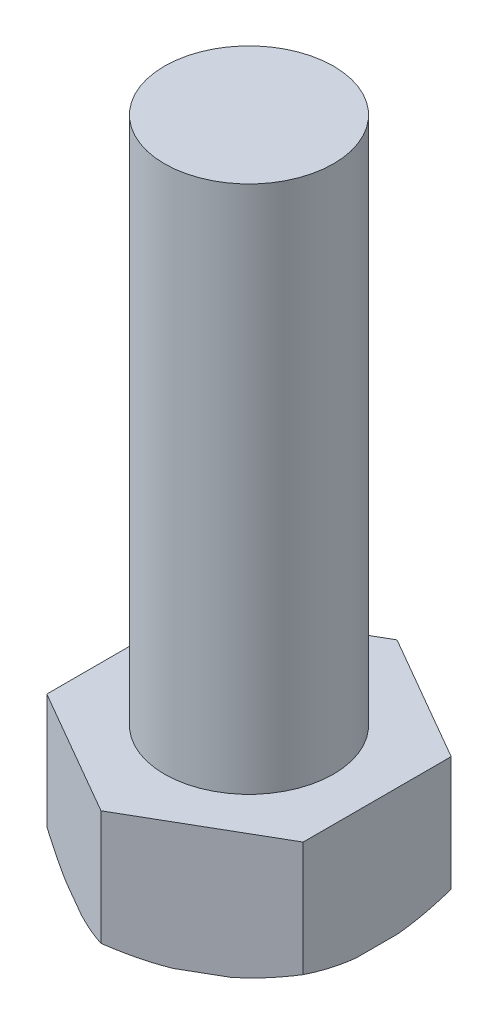
ISO-10303-21;
HEADER;
FILE_DESCRIPTION(('STEP AP214'),'2;1');
FILE_NAME('part.step','',(''),(''),'','','');
FILE_SCHEMA(('AUTOMOTIVE_DESIGN { 1 0 10303 214 1 1 1 1 }'));
ENDSEC;
DATA;
#1=APPLICATION_CONTEXT('core data for automotive mechanical design processes');
#2=APPLICATION_PROTOCOL_DEFINITION('international standard','automotive_design',2000,#1);
#3=PRODUCT_CONTEXT('',#1,'mechanical');
#4=PRODUCT('Part','Part','',(#3));
#5=PRODUCT_RELATED_PRODUCT_CATEGORY('part','',(#4));
#6=PRODUCT_DEFINITION_FORMATION('','',#4);
#7=PRODUCT_DEFINITION_CONTEXT('part definition',#1,'design');
#8=PRODUCT_DEFINITION('design','',#6,#7);
#9=PRODUCT_DEFINITION_SHAPE('','',#8);
#10=(LENGTH_UNIT() NAMED_UNIT(*) SI_UNIT(.MILLI.,.METRE.));
#11=(NAMED_UNIT(*) PLANE_ANGLE_UNIT() SI_UNIT($,.RADIAN.));
#12=(NAMED_UNIT(*) SI_UNIT($,.STERADIAN.) SOLID_ANGLE_UNIT());
#13=UNCERTAINTY_MEASURE_WITH_UNIT(LENGTH_MEASURE(1.E-05),#10,'distance_accuracy_value','');
#14=(GEOMETRIC_REPRESENTATION_CONTEXT(3) GLOBAL_UNCERTAINTY_ASSIGNED_CONTEXT((#13)) GLOBAL_UNIT_ASSIGNED_CONTEXT((#10,
#11,#12)) REPRESENTATION_CONTEXT('',''));
#15=CARTESIAN_POINT('',(0.,0.,0.));
#16=DIRECTION('',(0.,0.,1.));
#17=DIRECTION('',(1.,0.,0.));
#18=AXIS2_PLACEMENT_3D('',#15,#16,#17);
#19=CARTESIAN_POINT('',(0.,6.,0.));
#20=DIRECTION('',(0.,1.,0.));
#21=DIRECTION('',(0.,0.,1.));
#22=AXIS2_PLACEMENT_3D('',#19,#20,#21);
#23=PLANE('',#22);
#24=DIRECTION('',(0.,0.,-1.));
#25=VECTOR('',#24,1.);
#26=CARTESIAN_POINT('',(6.06217782649108,6.,3.50000000000001));
#27=LINE('',#26,#25);
#28=CARTESIAN_POINT('',(6.06217782649108,6.,3.50000000000001));
#29=VERTEX_POINT('',#28);
#30=CARTESIAN_POINT('',(6.06217782649108,6.,-3.5));
#31=VERTEX_POINT('',#30);
#32=EDGE_CURVE('E148',#29,#31,#27,.T.);
#33=ORIENTED_EDGE('',*,*,#32,.T.);
#34=DIRECTION('',(-0.866025403784439,0.,-0.5));
#35=VECTOR('',#34,1.);
#36=CARTESIAN_POINT('',(6.06217782649108,6.,-3.5));
#37=LINE('',#36,#35);
#38=CARTESIAN_POINT('',(0.,6.,-7.00000000000001));
#39=VERTEX_POINT('',#38);
#40=EDGE_CURVE('E152',#31,#39,#37,.T.);
#41=ORIENTED_EDGE('',*,*,#40,.T.);
#42=DIRECTION('',(-0.866025403784439,0.,0.5));
#43=VECTOR('',#42,1.);
#44=CARTESIAN_POINT('',(0.,6.,-7.00000000000001));
#45=LINE('',#44,#43);
#46=CARTESIAN_POINT('',(-6.06217782649107,6.,-3.50000000000001));
#47=VERTEX_POINT('',#46);
#48=EDGE_CURVE('E227',#39,#47,#45,.T.);
#49=ORIENTED_EDGE('',*,*,#48,.T.);
#50=DIRECTION('',(0.,0.,1.));
#51=VECTOR('',#50,1.);
#52=CARTESIAN_POINT('',(-6.06217782649107,6.,-3.50000000000001));
#53=LINE('',#52,#51);
#54=CARTESIAN_POINT('',(-6.06217782649107,6.,3.5));
#55=VERTEX_POINT('',#54);
#56=EDGE_CURVE('E230',#47,#55,#53,.T.);
#57=ORIENTED_EDGE('',*,*,#56,.T.);
#58=DIRECTION('',(0.866025403784439,0.,0.5));
#59=VECTOR('',#58,1.);
#60=CARTESIAN_POINT('',(-6.06217782649107,6.,3.5));
#61=LINE('',#60,#59);
#62=CARTESIAN_POINT('',(0.,6.,7.));
#63=VERTEX_POINT('',#62);
#64=EDGE_CURVE('E232',#55,#63,#61,.T.);
#65=ORIENTED_EDGE('',*,*,#64,.T.);
#66=DIRECTION('',(0.866025403784439,0.,-0.499999999999999));
#67=VECTOR('',#66,1.);
#68=CARTESIAN_POINT('',(0.,6.,7.));
#69=LINE('',#68,#67);
#70=EDGE_CURVE('E161',#63,#29,#69,.T.);
#71=ORIENTED_EDGE('',*,*,#70,.T.);
#72=EDGE_LOOP('',(#33,#41,#49,#57,#65,#71));
#73=FACE_BOUND('',#72,.T.);
#74=CARTESIAN_POINT('',(0.,6.,0.));
#75=DIRECTION('',(0.,1.,0.));
#76=DIRECTION('',(0.,0.,1.));
#77=AXIS2_PLACEMENT_3D('',#74,#75,#76);
#78=CIRCLE('',#77,4.);
#79=CARTESIAN_POINT('',(0.,6.,4.));
#80=VERTEX_POINT('',#79);
#81=EDGE_CURVE('E271',#80,#80,#78,.T.);
#82=ORIENTED_EDGE('',*,*,#81,.F.);
#83=EDGE_LOOP('',(#82));
#84=FACE_BOUND('',#83,.T.);
#85=ADVANCED_FACE('F33',(#73,#84),#23,.T.);
#86=CARTESIAN_POINT('',(6.06217782649108,6.,3.50000000000001));
#87=DIRECTION('',(-1.,0.,0.));
#88=DIRECTION('',(0.,0.,1.));
#89=AXIS2_PLACEMENT_3D('',#86,#87,#88);
#90=PLANE('',#89);
#91=CARTESIAN_POINT('',(6.06217782649108,2.43789574121351,-7.72794252533085));
#92=CARTESIAN_POINT('',(6.06217782649108,2.33372637561988,-7.52810237478054));
#93=CARTESIAN_POINT('',(6.06217782649108,2.23072983131782,-7.32764113334439));
#94=CARTESIAN_POINT('',(6.06217782649108,2.02760729588515,-6.92523168408071));
#95=CARTESIAN_POINT('',(6.06217782649108,1.92748175709833,-6.72328324816831));
#96=CARTESIAN_POINT('',(6.06217782649108,1.73026657653153,-6.31690824090425));
#97=CARTESIAN_POINT('',(6.06217782649108,1.63319063775422,-6.11247499778875));
#98=CARTESIAN_POINT('',(6.06217782649108,1.44321619253776,-5.70168109851371));
#99=CARTESIAN_POINT('',(6.06217782649108,1.35031751834762,-5.49532052015494));
#100=CARTESIAN_POINT('',(6.06217782649108,1.16687348802184,-5.0741780958761));
#101=CARTESIAN_POINT('',(6.06217782649108,1.07648172630288,-4.85932903069682));
#102=CARTESIAN_POINT('',(6.06217782649108,0.902265058197739,-4.42695613995605));
#103=CARTESIAN_POINT('',(6.06217782649108,0.81844055620381,-4.2094321506334));
#104=CARTESIAN_POINT('',(6.06217782649108,0.65896288839788,-3.77171337123132));
#105=CARTESIAN_POINT('',(6.06217782649108,0.583298905987358,-3.55152255778711));
#106=CARTESIAN_POINT('',(6.06217782649108,0.4418165225581,-3.10803240096646));
#107=CARTESIAN_POINT('',(6.06217782649108,0.375996442968831,-2.88473359467573));
#108=CARTESIAN_POINT('',(6.06217782649108,0.239660973240299,-2.372613123733));
#109=CARTESIAN_POINT('',(6.06217782649108,0.17288718632818,-2.08276028454217));
#110=CARTESIAN_POINT('',(6.06217782649108,0.0906406276588508,-1.64465597472184));
#111=CARTESIAN_POINT('',(6.06217782649108,0.0662099469618905,-1.49805890262899));
#112=CARTESIAN_POINT('',(6.06217782649108,0.0238174584437966,-1.20393910987824));
#113=CARTESIAN_POINT('',(6.06217782649108,0.0058547949252529,-1.05641651429333));
#114=CARTESIAN_POINT('',(6.06217782649108,-0.0230048508491095,-0.762578766579757));
#115=CARTESIAN_POINT('',(6.06217782649108,-0.0339890284681033,-0.616272212009262));
#116=CARTESIAN_POINT('',(6.06217782649108,-0.0489882964251195,-0.323301609784543));
#117=CARTESIAN_POINT('',(6.06217782649108,-0.0530034999883412,-0.176637567977197));
#118=CARTESIAN_POINT('',(6.06217782649108,-0.0539640504211664,0.116712588725086));
#119=CARTESIAN_POINT('',(6.06217782649108,-0.0509094850802412,0.263398703323315));
#120=CARTESIAN_POINT('',(6.06217782649108,-0.037808643624042,0.556459824760753));
#121=CARTESIAN_POINT('',(6.06217782649108,-0.0277620570564765,0.702834817496384));
#122=CARTESIAN_POINT('',(6.06217782649108,0.00218326009822013,1.02867293782461));
#123=CARTESIAN_POINT('',(6.06217782649108,0.0238203600383284,1.20797784065877));
#124=CARTESIAN_POINT('',(6.06217782649108,0.0765916906193381,1.5651741184812));
#125=CARTESIAN_POINT('',(6.06217782649108,0.107726771497942,1.74306536545884));
#126=CARTESIAN_POINT('',(6.06217782649108,0.214033662783059,2.27433275692997));
#127=CARTESIAN_POINT('',(6.06217782649108,0.302092248162821,2.62515556288582));
#128=CARTESIAN_POINT('',(6.06217782649108,0.505772257992106,3.32353353779641));
#129=CARTESIAN_POINT('',(6.06217782649108,0.621747860440046,3.6709816007798));
#130=CARTESIAN_POINT('',(6.06217782649108,0.873310753805371,4.35851851536316));
#131=CARTESIAN_POINT('',(6.06217782649108,1.00889385214743,4.69860892238822));
#132=CARTESIAN_POINT('',(6.06217782649108,1.24955730562395,5.26696301779312));
#133=CARTESIAN_POINT('',(6.06217782649108,1.35086896320851,5.49684856251776));
#134=CARTESIAN_POINT('',(6.06217782649108,1.55892616254881,5.95412343018143));
#135=CARTESIAN_POINT('',(6.06217782649108,1.66567126742279,6.18151295203402));
#136=CARTESIAN_POINT('',(6.06217782649108,1.88142112853599,6.62972079688601));
#137=CARTESIAN_POINT('',(6.06217782649108,1.99034038479028,6.85058048721899));
#138=CARTESIAN_POINT('',(6.06217782649108,2.21167478809308,7.29052031824548));
#139=CARTESIAN_POINT('',(6.06217782649108,2.32408964195907,7.50960060624747));
#140=CARTESIAN_POINT('',(6.06217782649108,2.43789574121351,7.72794252533085));
#141=B_SPLINE_CURVE_WITH_KNOTS('',3,(#91,#92,#93,#94,#95,#96,#97,#98,#99,#100,#101,#102,#103,
#104,#105,#106,#107,#108,#109,#110,#111,#112,#113,#114,#115,#116,#117,#118,#119,#120,#121,#122,
#123,#124,#125,#126,#127,#128,#129,#130,#131,#132,#133,#134,#135,#136,#137,#138,#139,#140),
.UNSPECIFIED.,.F.,.F.,(4,2,2,2,2,2,2,2,2,2,2,2,2,2,2,2,2,2,2,2,2,2,2,2,4),(0.,0.676090380584469,
1.35228670430852,2.03118030460178,2.71004661742696,3.40922629645472,4.1084489950969,
4.80673319342453,5.50489818507347,6.39627667532603,6.84201479006602,7.28769391343398,
7.72768874055769,8.167676419001,8.6076586338883,9.04766038564448,9.5891860690036,
10.1307602427453,11.2143497583801,12.3124872260279,13.4103902305238,14.1639819256836,
14.9175131229728,15.6562513112482,16.3949277063649),.UNSPECIFIED.);
#142=CARTESIAN_POINT('',(6.06217782649108,0.567915587203707,-3.5));
#143=VERTEX_POINT('',#142);
#144=CARTESIAN_POINT('',(6.06217782649108,0.,-0.99297715810348));
#145=VERTEX_POINT('',#144);
#146=EDGE_CURVE('E184',#143,#145,#141,.T.);
#147=ORIENTED_EDGE('',*,*,#146,.F.);
#148=DIRECTION('',(0.,-1.,0.));
#149=VECTOR('',#148,1.);
#150=CARTESIAN_POINT('',(6.06217782649108,6.,-3.5));
#151=LINE('',#150,#149);
#152=EDGE_CURVE('E132',#31,#143,#151,.T.);
#153=ORIENTED_EDGE('',*,*,#152,.F.);
#154=ORIENTED_EDGE('',*,*,#32,.F.);
#155=DIRECTION('',(0.,-1.,0.));
#156=VECTOR('',#155,1.);
#157=CARTESIAN_POINT('',(6.06217782649108,6.,3.50000000000001));
#158=LINE('',#157,#156);
#159=CARTESIAN_POINT('',(6.06217782649108,0.567915587203708,3.50000000000001));
#160=VERTEX_POINT('',#159);
#161=EDGE_CURVE('E158',#29,#160,#158,.T.);
#162=ORIENTED_EDGE('',*,*,#161,.T.);
#163=CARTESIAN_POINT('',(6.06217782649108,0.,0.99297715810348));
#164=VERTEX_POINT('',#163);
#165=EDGE_CURVE('E190',#164,#160,#141,.T.);
#166=ORIENTED_EDGE('',*,*,#165,.F.);
#167=DIRECTION('',(0.,0.,-1.));
#168=VECTOR('',#167,1.);
#169=CARTESIAN_POINT('',(6.06217782649108,0.,3.50000000000001));
#170=LINE('',#169,#168);
#171=EDGE_CURVE('E186',#164,#145,#170,.T.);
#172=ORIENTED_EDGE('',*,*,#171,.T.);
#173=EDGE_LOOP('',(#147,#153,#154,#162,#166,#172));
#174=FACE_BOUND('',#173,.T.);
#175=ADVANCED_FACE('F35',(#174),#90,.F.);
#176=CARTESIAN_POINT('',(6.06217782649108,6.,-3.5));
#177=DIRECTION('',(-0.5,0.,0.866025403784438));
#178=DIRECTION('',(0.866025403784439,0.,0.5));
#179=AXIS2_PLACEMENT_3D('',#176,#177,#178);
#180=PLANE('',#179);
#181=CARTESIAN_POINT('',(-4.22794252533083,2.78413033742595,-9.44100375511804));
#182=CARTESIAN_POINT('',(-4.0551992493319,2.67704690645948,-9.34127037821936));
#183=CARTESIAN_POINT('',(-3.88199013095912,2.57095298379033,-9.24126804710073));
#184=CARTESIAN_POINT('',(-3.53446180687353,2.3611672069405,-9.0406224756389));
#185=CARTESIAN_POINT('',(-3.36014248520178,2.25747560910396,-8.93997916834676));
#186=CARTESIAN_POINT('',(-3.00977365765123,2.0526608538228,-8.7376936314448));
#187=CARTESIAN_POINT('',(-2.83372072433894,1.95154549398434,-8.63604942300532));
#188=CARTESIAN_POINT('',(-2.48016787036315,1.75275290665366,-8.43192558758964));
#189=CARTESIAN_POINT('',(-2.30266799031728,1.6550755830579,-8.32944598406403));
#190=CARTESIAN_POINT('',(-1.93934621388186,1.4602938029554,-8.11968205863659));
#191=CARTESIAN_POINT('',(-1.75346085458417,1.36334660307675,-8.01236109640765));
#192=CARTESIAN_POINT('',(-1.37963324665582,1.17489813460143,-7.79653162633971));
#193=CARTESIAN_POINT('',(-1.19169109684028,1.08339660572448,-7.68802317555163));
#194=CARTESIAN_POINT('',(-0.813616361249958,0.907145319277612,-7.46974162518476));
#195=CARTESIAN_POINT('',(-0.623485750757204,0.822389947665541,-7.35996966603558));
#196=CARTESIAN_POINT('',(-0.240643291336267,0.661089721753563,-7.13893546903168));
#197=CARTESIAN_POINT('',(-0.0479317658889084,0.584543849145285,-7.02767341793871));
#198=CARTESIAN_POINT('',(0.393679524845285,0.421809658000144,-6.77270902035614));
#199=CARTESIAN_POINT('',(0.643460132625659,0.338756567642329,-6.62849811921579));
#200=CARTESIAN_POINT('',(1.14761870871831,0.19342845278709,-6.33742202959444));
#201=CARTESIAN_POINT('',(1.40199617950623,0.131151193725659,-6.19055712835926));
#202=CARTESIAN_POINT('',(1.78445071254088,0.0571050513924404,-5.96974690075891));
#203=CARTESIAN_POINT('',(1.91115797447828,0.0357383265672531,-5.89659242897108));
#204=CARTESIAN_POINT('',(2.16527133649301,-0.000390562628702899,-5.74988001100719));
#205=CARTESIAN_POINT('',(2.29267734883182,-0.0151535378120996,-5.676322115487));
#206=CARTESIAN_POINT('',(2.54793858849085,-0.0377240972440039,-5.52894697005618));
#207=CARTESIAN_POINT('',(2.67579376460667,-0.0455324500358681,-5.45512974970843));
#208=CARTESIAN_POINT('',(2.93168261687338,-0.054003424528002,-5.30739225196962));
#209=CARTESIAN_POINT('',(3.05971629280411,-0.0546660550341385,-5.23347197470568));
#210=CARTESIAN_POINT('',(3.31607919444889,-0.0488166975883611,-5.08546078443082));
#211=CARTESIAN_POINT('',(3.44440802269684,-0.0422813097744065,-5.01137010089708));
#212=CARTESIAN_POINT('',(3.70065637118745,-0.0221705620356174,-4.86342504791663));
#213=CARTESIAN_POINT('',(3.82857584087392,-0.00859436394620576,-4.78957070765855));
#214=CARTESIAN_POINT('',(4.21134505742529,0.0422461834792024,-4.56857879744511));
#215=CARTESIAN_POINT('',(4.46522127883581,0.089622906853333,-4.42200329267291));
#216=CARTESIAN_POINT('',(4.97247392510589,0.208265042184961,-4.12914084080172));
#217=CARTESIAN_POINT('',(5.22578877774077,0.279869581903287,-3.98288944244325));
#218=CARTESIAN_POINT('',(5.72776123402621,0.442054436198751,-3.69307550968107));
#219=CARTESIAN_POINT('',(5.97641864031662,0.532635552938954,-3.54951308922331));
#220=CARTESIAN_POINT('',(6.4023836449678,0.701955849419386,-3.30358207912259));
#221=CARTESIAN_POINT('',(6.58074128886334,0.777237676199964,-3.20060724540747));
#222=CARTESIAN_POINT('',(6.93531327752798,0.93428557526075,-2.99589501230484));
#223=CARTESIAN_POINT('',(7.11152745692726,1.01605214422954,-2.89415770839364));
#224=CARTESIAN_POINT('',(7.46211042230037,1.18497317485409,-2.69174853896218));
#225=CARTESIAN_POINT('',(7.63647814898608,1.27213055176785,-2.5910772850222));
#226=CARTESIAN_POINT('',(7.98350466579792,1.45087323279685,-2.39072143212495));
#227=CARTESIAN_POINT('',(8.1561633984744,1.54245868516162,-2.29103686633624));
#228=CARTESIAN_POINT('',(8.49410190103468,1.72611402440618,-2.09592798091352));
#229=CARTESIAN_POINT('',(8.65943217969644,1.81806036915518,-2.00047450002296));
#230=CARTESIAN_POINT('',(8.98886638044616,2.00484162843025,-1.81027557553984));
#231=CARTESIAN_POINT('',(9.15297027717811,2.09967660247543,-1.71553014658658));
#232=CARTESIAN_POINT('',(9.47979306545078,2.29160383482558,-1.52683892180005));
#233=CARTESIAN_POINT('',(9.64251398611346,2.38869149610942,-1.43289195445267));
#234=CARTESIAN_POINT('',(9.96699913605921,2.58494067247519,-1.24555036578345));
#235=CARTESIAN_POINT('',(10.1287634414198,2.68410201971698,-1.15215570053824));
#236=CARTESIAN_POINT('',(10.2901203518219,2.78413033742596,-1.05899624488197));
#237=B_SPLINE_CURVE_WITH_KNOTS('',3,(#181,#182,#183,#184,#185,#186,#187,#188,#189,#190,#191,
#192,#193,#194,#195,#196,#197,#198,#199,#200,#201,#202,#203,#204,#205,#206,#207,#208,#209,#210,
#211,#212,#213,#214,#215,#216,#217,#218,#219,#220,#221,#222,#223,#224,#225,#226,#227,#228,#229,
#230,#231,#232,#233,#234,#235,#236),.UNSPECIFIED.,.F.,.F.,(4,2,2,2,2,2,2,2,2,2,2,2,2,2,2,2,2,2,
2,2,2,2,2,2,2,2,2,4),(0.,0.67918535373627,1.35844285036914,2.0395575281427,2.72065315155207,
3.42715287929773,4.1336188121483,4.83949055149416,5.54527463281586,6.44510843337576,
7.34484542024093,7.78830209769288,8.23170431229379,8.67505752119698,9.11841018374396,
9.56320839605543,10.0080595709801,10.8977078488388,11.8003628494762,12.7030560141437,
13.3607767706823,14.0185479530459,14.676678010892,15.3348301178475,15.9704878149634,
16.606158618438,17.240629949928,17.87505012578),.UNSPECIFIED.);
#238=CARTESIAN_POINT('',(0.,0.567915587203705,-7.00000000000001));
#239=VERTEX_POINT('',#238);
#240=CARTESIAN_POINT('',(2.17114546895025,0.,-5.74648857905175));
#241=VERTEX_POINT('',#240);
#242=EDGE_CURVE('E50',#239,#241,#237,.T.);
#243=ORIENTED_EDGE('',*,*,#242,.F.);
#244=DIRECTION('',(0.,-1.,0.));
#245=VECTOR('',#244,1.);
#246=CARTESIAN_POINT('',(0.,6.,-7.00000000000001));
#247=LINE('',#246,#245);
#248=EDGE_CURVE('E169',#39,#239,#247,.T.);
#249=ORIENTED_EDGE('',*,*,#248,.F.);
#250=ORIENTED_EDGE('',*,*,#40,.F.);
#251=ORIENTED_EDGE('',*,*,#152,.T.);
#252=CARTESIAN_POINT('',(3.89103235754083,0.,-4.75351142094827));
#253=VERTEX_POINT('',#252);
#254=EDGE_CURVE('E177',#253,#143,#237,.T.);
#255=ORIENTED_EDGE('',*,*,#254,.F.);
#256=DIRECTION('',(-0.866025403784439,0.,-0.5));
#257=VECTOR('',#256,1.);
#258=CARTESIAN_POINT('',(6.06217782649108,0.,-3.5));
#259=LINE('',#258,#257);
#260=EDGE_CURVE('E197',#253,#241,#259,.T.);
#261=ORIENTED_EDGE('',*,*,#260,.T.);
#262=EDGE_LOOP('',(#243,#249,#250,#251,#255,#261));
#263=FACE_BOUND('',#262,.T.);
#264=ADVANCED_FACE('F175',(#263),#180,.F.);
#265=CARTESIAN_POINT('',(0.,6.,-7.00000000000001));
#266=DIRECTION('',(0.5,0.,0.866025403784439));
#267=DIRECTION('',(0.866025403784439,0.,-0.5));
#268=AXIS2_PLACEMENT_3D('',#265,#266,#267);
#269=PLANE('',#268);
#270=CARTESIAN_POINT('',(-10.2901203518219,2.78413033742595,-1.05899624488198));
#271=CARTESIAN_POINT('',(-10.117377075823,2.67704690645948,-1.15872962178066));
#272=CARTESIAN_POINT('',(-9.9441679574502,2.57095298379033,-1.25873195289928));
#273=CARTESIAN_POINT('',(-9.59663963336461,2.3611672069405,-1.45937752436112));
#274=CARTESIAN_POINT('',(-9.42232031169286,2.25747560910395,-1.56002083165325));
#275=CARTESIAN_POINT('',(-9.0719514841423,2.0526608538228,-1.76230636855522));
#276=CARTESIAN_POINT('',(-8.89589855083001,1.95154549398434,-1.86395057699469));
#277=CARTESIAN_POINT('',(-8.54234569685422,1.75275290665365,-2.06807441241038));
#278=CARTESIAN_POINT('',(-8.36484581680836,1.65507558305789,-2.17055401593598));
#279=CARTESIAN_POINT('',(-8.00152404037294,1.4602938029554,-2.38031794136343));
#280=CARTESIAN_POINT('',(-7.81563868107525,1.36334660307674,-2.48763890359236));
#281=CARTESIAN_POINT('',(-7.4418110731469,1.17489813460143,-2.7034683736603));
#282=CARTESIAN_POINT('',(-7.25386892333135,1.08339660572448,-2.81197682444839));
#283=CARTESIAN_POINT('',(-6.87579418774104,0.907145319277608,-3.03025837481525));
#284=CARTESIAN_POINT('',(-6.68566357724828,0.822389947665537,-3.14003033396443));
#285=CARTESIAN_POINT('',(-6.30282111782734,0.661089721753559,-3.36106453096833));
#286=CARTESIAN_POINT('',(-6.11010959237999,0.584543849145281,-3.4723265820613));
#287=CARTESIAN_POINT('',(-5.66849830164579,0.421809658000141,-3.72729097964387));
#288=CARTESIAN_POINT('',(-5.41871769386542,0.338756567642326,-3.87150188078422));
#289=CARTESIAN_POINT('',(-4.91455911777277,0.193428452787087,-4.16257797040557));
#290=CARTESIAN_POINT('',(-4.66018164698485,0.131151193725656,-4.30944287164075));
#291=CARTESIAN_POINT('',(-4.2777271139502,0.0571050513924369,-4.5302530992411));
#292=CARTESIAN_POINT('',(-4.1510198520128,0.0357383265672492,-4.60340757102893));
#293=CARTESIAN_POINT('',(-3.89690648999806,-0.000390562628707032,-4.75011998899282));
#294=CARTESIAN_POINT('',(-3.76950047765926,-0.0151535378121036,-4.82367788451301));
#295=CARTESIAN_POINT('',(-3.51423923800022,-0.0377240972440078,-4.97105302994383));
#296=CARTESIAN_POINT('',(-3.38638406188441,-0.0455324500358721,-5.04487025029158));
#297=CARTESIAN_POINT('',(-3.1304952096177,-0.054003424528006,-5.19260774803039));
#298=CARTESIAN_POINT('',(-3.00246153368697,-0.0546660550341426,-5.26652802529433));
#299=CARTESIAN_POINT('',(-2.74609863204218,-0.0488166975883653,-5.41453921556918));
#300=CARTESIAN_POINT('',(-2.61776980379424,-0.0422813097744107,-5.48862989910293));
#301=CARTESIAN_POINT('',(-2.36152145530363,-0.0221705620356216,-5.63657495208338));
#302=CARTESIAN_POINT('',(-2.23360198561716,-0.00859436394620993,-5.71042929234145));
#303=CARTESIAN_POINT('',(-1.85083276906578,0.0422461834791984,-5.93142120255489));
#304=CARTESIAN_POINT('',(-1.59695654765527,0.0896229068533289,-6.0779967073271));
#305=CARTESIAN_POINT('',(-1.08970390138519,0.208265042184956,-6.37085915919828));
#306=CARTESIAN_POINT('',(-0.836389048750308,0.279869581903282,-6.51711055755676));
#307=CARTESIAN_POINT('',(-0.334416592464871,0.442054436198745,-6.80692449031893));
#308=CARTESIAN_POINT('',(-0.0857591861744644,0.532635552938948,-6.95048691077669));
#309=CARTESIAN_POINT('',(0.340205818476716,0.701955849419381,-7.19641792087741));
#310=CARTESIAN_POINT('',(0.518563462372263,0.777237676199959,-7.29939275459253));
#311=CARTESIAN_POINT('',(0.873135451036904,0.934285575260745,-7.50410498769516));
#312=CARTESIAN_POINT('',(1.04934963043618,1.01605214422953,-7.60584229160636));
#313=CARTESIAN_POINT('',(1.39993259580929,1.18497317485409,-7.80825146103783));
#314=CARTESIAN_POINT('',(1.574300322495,1.27213055176784,-7.90892271497781));
#315=CARTESIAN_POINT('',(1.92132683930684,1.45087323279684,-8.10927856787506));
#316=CARTESIAN_POINT('',(2.09398557198332,1.54245868516161,-8.20896313366376));
#317=CARTESIAN_POINT('',(2.4319240745436,1.72611402440618,-8.40407201908648));
#318=CARTESIAN_POINT('',(2.59725435320536,1.81806036915517,-8.49952549997704));
#319=CARTESIAN_POINT('',(2.92668855395509,2.00484162843024,-8.68972442446017));
#320=CARTESIAN_POINT('',(3.09079245068703,2.09967660247543,-8.78446985341342));
#321=CARTESIAN_POINT('',(3.4176152389597,2.29160383482558,-8.97316107819995));
#322=CARTESIAN_POINT('',(3.58033615962239,2.38869149610942,-9.06710804554734));
#323=CARTESIAN_POINT('',(3.90482130956814,2.58494067247519,-9.25444963421655));
#324=CARTESIAN_POINT('',(4.06658561492873,2.68410201971698,-9.34784429946176));
#325=CARTESIAN_POINT('',(4.22794252533085,2.78413033742596,-9.44100375511803));
#326=B_SPLINE_CURVE_WITH_KNOTS('',3,(#270,#271,#272,#273,#274,#275,#276,#277,#278,#279,#280,
#281,#282,#283,#284,#285,#286,#287,#288,#289,#290,#291,#292,#293,#294,#295,#296,#297,#298,#299,
#300,#301,#302,#303,#304,#305,#306,#307,#308,#309,#310,#311,#312,#313,#314,#315,#316,#317,#318,
#319,#320,#321,#322,#323,#324,#325),.UNSPECIFIED.,.F.,.F.,(4,2,2,2,2,2,2,2,2,2,2,2,2,2,2,2,2,2,
2,2,2,2,2,2,2,2,2,4),(0.,0.67918535373627,1.35844285036914,2.0395575281427,2.72065315155207,
3.42715287929773,4.13361881214829,4.83949055149416,5.54527463281586,6.44510843337575,
7.34484542024093,7.78830209769288,8.23170431229379,8.67505752119698,9.11841018374395,
9.56320839605542,10.0080595709801,10.8977078488388,11.8003628494762,12.7030560141437,
13.3607767706823,14.0185479530459,14.676678010892,15.3348301178475,15.9704878149634,
16.606158618438,17.240629949928,17.87505012578),.UNSPECIFIED.);
#327=CARTESIAN_POINT('',(-6.06217782649107,0.5679155872037,-3.50000000000001));
#328=VERTEX_POINT('',#327);
#329=CARTESIAN_POINT('',(-3.89103235754086,0.,-4.75351142094824));
#330=VERTEX_POINT('',#329);
#331=EDGE_CURVE('E58',#328,#330,#326,.T.);
#332=ORIENTED_EDGE('',*,*,#331,.F.);
#333=DIRECTION('',(0.,-1.,0.));
#334=VECTOR('',#333,1.);
#335=CARTESIAN_POINT('',(-6.06217782649107,6.,-3.50000000000001));
#336=LINE('',#335,#334);
#337=EDGE_CURVE('E166',#47,#328,#336,.T.);
#338=ORIENTED_EDGE('',*,*,#337,.F.);
#339=ORIENTED_EDGE('',*,*,#48,.F.);
#340=ORIENTED_EDGE('',*,*,#248,.T.);
#341=CARTESIAN_POINT('',(-2.17114546895021,0.,-5.74648857905176));
#342=VERTEX_POINT('',#341);
#343=EDGE_CURVE('E223',#342,#239,#326,.T.);
#344=ORIENTED_EDGE('',*,*,#343,.F.);
#345=DIRECTION('',(-0.866025403784439,0.,0.5));
#346=VECTOR('',#345,1.);
#347=CARTESIAN_POINT('',(0.,0.,-7.00000000000001));
#348=LINE('',#347,#346);
#349=EDGE_CURVE('E199',#342,#330,#348,.T.);
#350=ORIENTED_EDGE('',*,*,#349,.T.);
#351=EDGE_LOOP('',(#332,#338,#339,#340,#344,#350));
#352=FACE_BOUND('',#351,.T.);
#353=ADVANCED_FACE('F225',(#352),#269,.F.);
#354=CARTESIAN_POINT('',(-6.06217782649107,6.,-3.50000000000001));
#355=DIRECTION('',(1.,0.,0.));
#356=DIRECTION('',(0.,0.,-1.));
#357=AXIS2_PLACEMENT_3D('',#354,#355,#356);
#358=PLANE('',#357);
#359=CARTESIAN_POINT('',(-6.06217782649107,2.4378957412135,7.72794252533084));
#360=CARTESIAN_POINT('',(-6.06217782649107,2.33372637561987,7.52810237478053));
#361=CARTESIAN_POINT('',(-6.06217782649107,2.23072983131781,7.32764113334438));
#362=CARTESIAN_POINT('',(-6.06217782649107,2.02760729588514,6.9252316840807));
#363=CARTESIAN_POINT('',(-6.06217782649107,1.92748175709832,6.7232832481683));
#364=CARTESIAN_POINT('',(-6.06217782649107,1.73026657653152,6.31690824090424));
#365=CARTESIAN_POINT('',(-6.06217782649107,1.63319063775421,6.11247499778875));
#366=CARTESIAN_POINT('',(-6.06217782649107,1.44321619253775,5.70168109851371));
#367=CARTESIAN_POINT('',(-6.06217782649107,1.35031751834761,5.49532052015493));
#368=CARTESIAN_POINT('',(-6.06217782649107,1.16687348802183,5.0741780958761));
#369=CARTESIAN_POINT('',(-6.06217782649107,1.07648172630287,4.85932903069682));
#370=CARTESIAN_POINT('',(-6.06217782649107,0.90226505819773,4.42695613995605));
#371=CARTESIAN_POINT('',(-6.06217782649107,0.818440556203802,4.2094321506334));
#372=CARTESIAN_POINT('',(-6.06217782649107,0.658962888397872,3.77171337123132));
#373=CARTESIAN_POINT('',(-6.06217782649107,0.58329890598735,3.55152255778711));
#374=CARTESIAN_POINT('',(-6.06217782649107,0.441816522558093,3.10803240096646));
#375=CARTESIAN_POINT('',(-6.06217782649107,0.375996442968824,2.88473359467573));
#376=CARTESIAN_POINT('',(-6.06217782649107,0.239660973240292,2.37261312373301));
#377=CARTESIAN_POINT('',(-6.06217782649107,0.172887186328172,2.08276028454218));
#378=CARTESIAN_POINT('',(-6.06217782649107,0.0906406276588433,1.64465597472185));
#379=CARTESIAN_POINT('',(-6.06217782649107,0.0662099469618831,1.498058902629));
#380=CARTESIAN_POINT('',(-6.06217782649107,0.023817458443789,1.20393910987825));
#381=CARTESIAN_POINT('',(-6.06217782649107,0.00585479492524498,1.05641651429334));
#382=CARTESIAN_POINT('',(-6.06217782649107,-0.0230048508491179,0.762578766579768));
#383=CARTESIAN_POINT('',(-6.06217782649107,-0.0339890284681117,0.616272212009274));
#384=CARTESIAN_POINT('',(-6.06217782649107,-0.0489882964251283,0.323301609784554));
#385=CARTESIAN_POINT('',(-6.06217782649107,-0.0530034999883502,0.176637567977209));
#386=CARTESIAN_POINT('',(-6.06217782649107,-0.0539640504211758,-0.116712588725073));
#387=CARTESIAN_POINT('',(-6.06217782649107,-0.0509094850802506,-0.263398703323302));
#388=CARTESIAN_POINT('',(-6.06217782649107,-0.037808643624052,-0.556459824760739));
#389=CARTESIAN_POINT('',(-6.06217782649107,-0.027762057056487,-0.702834817496369));
#390=CARTESIAN_POINT('',(-6.06217782649107,0.00218326009820879,-1.02867293782459));
#391=CARTESIAN_POINT('',(-6.06217782649107,0.0238203600383168,-1.20797784065875));
#392=CARTESIAN_POINT('',(-6.06217782649107,0.0765916906193256,-1.56517411848118));
#393=CARTESIAN_POINT('',(-6.06217782649107,0.107726771497929,-1.74306536545881));
#394=CARTESIAN_POINT('',(-6.06217782649107,0.214033662783044,-2.27433275692995));
#395=CARTESIAN_POINT('',(-6.06217782649107,0.302092248162806,-2.62515556288579));
#396=CARTESIAN_POINT('',(-6.06217782649107,0.505772257992089,-3.32353353779638));
#397=CARTESIAN_POINT('',(-6.06217782649107,0.621747860440027,-3.67098160077977));
#398=CARTESIAN_POINT('',(-6.06217782649107,0.87331075380535,-4.35851851536312));
#399=CARTESIAN_POINT('',(-6.06217782649107,1.00889385214741,-4.69860892238818));
#400=CARTESIAN_POINT('',(-6.06217782649107,1.24955730562393,-5.26696301779309));
#401=CARTESIAN_POINT('',(-6.06217782649107,1.35086896320849,-5.49684856251773));
#402=CARTESIAN_POINT('',(-6.06217782649107,1.5589261625488,-5.9541234301814));
#403=CARTESIAN_POINT('',(-6.06217782649107,1.66567126742277,-6.18151295203399));
#404=CARTESIAN_POINT('',(-6.06217782649107,1.88142112853598,-6.62972079688599));
#405=CARTESIAN_POINT('',(-6.06217782649107,1.99034038479027,-6.85058048721898));
#406=CARTESIAN_POINT('',(-6.06217782649107,2.21167478809306,-7.29052031824547));
#407=CARTESIAN_POINT('',(-6.06217782649107,2.32408964195906,-7.50960060624746));
#408=CARTESIAN_POINT('',(-6.06217782649107,2.43789574121351,-7.72794252533085));
#409=B_SPLINE_CURVE_WITH_KNOTS('',3,(#359,#360,#361,#362,#363,#364,#365,#366,#367,#368,#369,
#370,#371,#372,#373,#374,#375,#376,#377,#378,#379,#380,#381,#382,#383,#384,#385,#386,#387,#388,
#389,#390,#391,#392,#393,#394,#395,#396,#397,#398,#399,#400,#401,#402,#403,#404,#405,#406,#407,
#408),.UNSPECIFIED.,.F.,.F.,(4,2,2,2,2,2,2,2,2,2,2,2,2,2,2,2,2,2,2,2,2,2,2,2,4),(0.,
0.676090380584467,1.35228670430851,2.03118030460177,2.71004661742696,3.40922629645471,
4.10844899509689,4.80673319342451,5.50489818507346,6.396276675326,6.84201479006599,
7.28769391343395,7.72768874055767,8.16767641900097,8.60765863388827,9.04766038564445,
9.58918606900357,10.1307602427453,11.21434975838,12.3124872260278,13.4103902305238,
14.1639819256836,14.9175131229727,15.6562513112482,16.3949277063649),.UNSPECIFIED.);
#410=CARTESIAN_POINT('',(-6.06217782649107,0.567915587203697,3.5));
#411=VERTEX_POINT('',#410);
#412=CARTESIAN_POINT('',(-6.06217782649107,0.,0.992977158103565));
#413=VERTEX_POINT('',#412);
#414=EDGE_CURVE('E212',#411,#413,#409,.T.);
#415=ORIENTED_EDGE('',*,*,#414,.F.);
#416=DIRECTION('',(0.,-1.,0.));
#417=VECTOR('',#416,1.);
#418=CARTESIAN_POINT('',(-6.06217782649107,6.,3.5));
#419=LINE('',#418,#417);
#420=EDGE_CURVE('E163',#55,#411,#419,.T.);
#421=ORIENTED_EDGE('',*,*,#420,.F.);
#422=ORIENTED_EDGE('',*,*,#56,.F.);
#423=ORIENTED_EDGE('',*,*,#337,.T.);
#424=CARTESIAN_POINT('',(-6.06217782649107,0.,-0.992977158103565));
#425=VERTEX_POINT('',#424);
#426=EDGE_CURVE('E213',#425,#328,#409,.T.);
#427=ORIENTED_EDGE('',*,*,#426,.F.);
#428=DIRECTION('',(0.,0.,1.));
#429=VECTOR('',#428,1.);
#430=CARTESIAN_POINT('',(-6.06217782649107,0.,-3.50000000000001));
#431=LINE('',#430,#429);
#432=EDGE_CURVE('E154',#425,#413,#431,.T.);
#433=ORIENTED_EDGE('',*,*,#432,.T.);
#434=EDGE_LOOP('',(#415,#421,#422,#423,#427,#433));
#435=FACE_BOUND('',#434,.T.);
#436=ADVANCED_FACE('F210',(#435),#358,.F.);
#437=CARTESIAN_POINT('',(-6.06217782649107,6.,3.5));
#438=DIRECTION('',(0.5,0.,-0.866025403784438));
#439=DIRECTION('',(-0.866025403784439,0.,-0.5));
#440=AXIS2_PLACEMENT_3D('',#437,#438,#439);
#441=PLANE('',#440);
#442=CARTESIAN_POINT('',(4.22794252533085,2.78413033742595,9.44100375511803));
#443=CARTESIAN_POINT('',(4.05519924933192,2.67704690645948,9.34127037821935));
#444=CARTESIAN_POINT('',(3.88199013095914,2.57095298379033,9.24126804710073));
#445=CARTESIAN_POINT('',(3.53446180687355,2.3611672069405,9.04062247563889));
#446=CARTESIAN_POINT('',(3.3601424852018,2.25747560910396,8.93997916834675));
#447=CARTESIAN_POINT('',(3.00977365765125,2.0526608538228,8.73769363144479));
#448=CARTESIAN_POINT('',(2.83372072433896,1.95154549398434,8.63604942300531));
#449=CARTESIAN_POINT('',(2.48016787036317,1.75275290665366,8.43192558758963));
#450=CARTESIAN_POINT('',(2.3026679903173,1.6550755830579,8.32944598406402));
#451=CARTESIAN_POINT('',(1.93934621388188,1.46029380295541,8.11968205863658));
#452=CARTESIAN_POINT('',(1.7534608545842,1.36334660307675,8.01236109640765));
#453=CARTESIAN_POINT('',(1.37963324665585,1.17489813460143,7.7965316263397));
#454=CARTESIAN_POINT('',(1.1916910968403,1.08339660572448,7.68802317555162));
#455=CARTESIAN_POINT('',(0.813616361249985,0.907145319277613,7.46974162518476));
#456=CARTESIAN_POINT('',(0.623485750757231,0.822389947665541,7.35996966603558));
#457=CARTESIAN_POINT('',(0.240643291336296,0.661089721753563,7.13893546903168));
#458=CARTESIAN_POINT('',(0.0479317658889375,0.584543849145285,7.02767341793871));
#459=CARTESIAN_POINT('',(-0.393679524845256,0.421809658000144,6.77270902035614));
#460=CARTESIAN_POINT('',(-0.643460132625629,0.338756567642329,6.6284981192158));
#461=CARTESIAN_POINT('',(-1.14761870871828,0.193428452787088,6.33742202959444));
#462=CARTESIAN_POINT('',(-1.4019961795062,0.131151193725656,6.19055712835926));
#463=CARTESIAN_POINT('',(-1.78445071254085,0.057105051392436,5.96974690075892));
#464=CARTESIAN_POINT('',(-1.91115797447824,0.0357383265672479,5.89659242897108));
#465=CARTESIAN_POINT('',(-2.16527133649298,-0.00039056262870912,5.74988001100719));
#466=CARTESIAN_POINT('',(-2.29267734883178,-0.0151535378121059,5.676322115487));
#467=CARTESIAN_POINT('',(-2.54793858849082,-0.0377240972440111,5.52894697005618));
#468=CARTESIAN_POINT('',(-2.67579376460664,-0.0455324500358761,5.45512974970843));
#469=CARTESIAN_POINT('',(-2.93168261687335,-0.054003424528011,5.30739225196962));
#470=CARTESIAN_POINT('',(-3.05971629280407,-0.0546660550341478,5.23347197470568));
#471=CARTESIAN_POINT('',(-3.31607919444886,-0.0488166975883714,5.08546078443083));
#472=CARTESIAN_POINT('',(-3.44440802269681,-0.0422813097744176,5.01137010089708));
#473=CARTESIAN_POINT('',(-3.70065637118742,-0.0221705620356291,4.86342504791663));
#474=CARTESIAN_POINT('',(-3.82857584087389,-0.00859436394621725,4.78957070765856));
#475=CARTESIAN_POINT('',(-4.21134505742526,0.0422461834791905,4.56857879744512));
#476=CARTESIAN_POINT('',(-4.46522127883578,0.0896229068533194,4.42200329267291));
#477=CARTESIAN_POINT('',(-4.97247392510586,0.208265042184945,4.12914084080173));
#478=CARTESIAN_POINT('',(-5.22578877774074,0.279869581903272,3.98288944244325));
#479=CARTESIAN_POINT('',(-5.72776123402618,0.442054436198735,3.69307550968108));
#480=CARTESIAN_POINT('',(-5.97641864031658,0.532635552938937,3.54951308922332));
#481=CARTESIAN_POINT('',(-6.40238364496776,0.701955849419368,3.3035820791226));
#482=CARTESIAN_POINT('',(-6.58074128886331,0.777237676199946,3.20060724540747));
#483=CARTESIAN_POINT('',(-6.93531327752795,0.934285575260733,2.99589501230484));
#484=CARTESIAN_POINT('',(-7.11152745692723,1.01605214422952,2.89415770839364));
#485=CARTESIAN_POINT('',(-7.46211042230034,1.18497317485408,2.69174853896218));
#486=CARTESIAN_POINT('',(-7.63647814898606,1.27213055176783,2.5910772850222));
#487=CARTESIAN_POINT('',(-7.9835046657979,1.45087323279683,2.39072143212494));
#488=CARTESIAN_POINT('',(-8.15616339847438,1.5424586851616,2.29103686633624));
#489=CARTESIAN_POINT('',(-8.49410190103466,1.72611402440617,2.09592798091352));
#490=CARTESIAN_POINT('',(-8.65943217969642,1.81806036915517,2.00047450002296));
#491=CARTESIAN_POINT('',(-8.98886638044615,2.00484162843023,1.81027557553983));
#492=CARTESIAN_POINT('',(-9.1529702771781,2.09967660247542,1.71553014658658));
#493=CARTESIAN_POINT('',(-9.47979306545076,2.29160383482557,1.52683892180005));
#494=CARTESIAN_POINT('',(-9.64251398611345,2.38869149610941,1.43289195445266));
#495=CARTESIAN_POINT('',(-9.9669991360592,2.58494067247518,1.24555036578345));
#496=CARTESIAN_POINT('',(-10.1287634414198,2.68410201971697,1.15215570053824));
#497=CARTESIAN_POINT('',(-10.2901203518219,2.78413033742595,1.05899624488197));
#498=B_SPLINE_CURVE_WITH_KNOTS('',3,(#442,#443,#444,#445,#446,#447,#448,#449,#450,#451,#452,
#453,#454,#455,#456,#457,#458,#459,#460,#461,#462,#463,#464,#465,#466,#467,#468,#469,#470,#471,
#472,#473,#474,#475,#476,#477,#478,#479,#480,#481,#482,#483,#484,#485,#486,#487,#488,#489,#490,
#491,#492,#493,#494,#495,#496,#497),.UNSPECIFIED.,.F.,.F.,(4,2,2,2,2,2,2,2,2,2,2,2,2,2,2,2,2,2,
2,2,2,2,2,2,2,2,2,4),(0.,0.679185353736269,1.35844285036913,2.0395575281427,2.72065315155207,
3.42715287929772,4.13361881214829,4.83949055149415,5.54527463281585,6.44510843337574,
7.34484542024092,7.78830209769287,8.23170431229378,8.67505752119697,9.11841018374394,
9.56320839605541,10.0080595709801,10.8977078488388,11.8003628494762,12.7030560141437,
13.3607767706823,14.0185479530459,14.676678010892,15.3348301178475,15.9704878149634,
16.606158618438,17.240629949928,17.8750501257801),.UNSPECIFIED.);
#499=CARTESIAN_POINT('',(0.,0.567915587203701,7.));
#500=VERTEX_POINT('',#499);
#501=CARTESIAN_POINT('',(-2.17114546895017,0.,5.74648857905178));
#502=VERTEX_POINT('',#501);
#503=EDGE_CURVE('E126',#500,#502,#498,.T.);
#504=ORIENTED_EDGE('',*,*,#503,.F.);
#505=DIRECTION('',(0.,-1.,0.));
#506=VECTOR('',#505,1.);
#507=CARTESIAN_POINT('',(0.,6.,7.));
#508=LINE('',#507,#506);
#509=EDGE_CURVE('E141',#63,#500,#508,.T.);
#510=ORIENTED_EDGE('',*,*,#509,.F.);
#511=ORIENTED_EDGE('',*,*,#64,.F.);
#512=ORIENTED_EDGE('',*,*,#420,.T.);
#513=CARTESIAN_POINT('',(-3.8910323575409,0.,4.75351142094821));
#514=VERTEX_POINT('',#513);
#515=EDGE_CURVE('E277',#514,#411,#498,.T.);
#516=ORIENTED_EDGE('',*,*,#515,.F.);
#517=DIRECTION('',(0.866025403784439,0.,0.5));
#518=VECTOR('',#517,1.);
#519=CARTESIAN_POINT('',(-6.06217782649107,0.,3.5));
#520=LINE('',#519,#518);
#521=EDGE_CURVE('E149',#514,#502,#520,.T.);
#522=ORIENTED_EDGE('',*,*,#521,.T.);
#523=EDGE_LOOP('',(#504,#510,#511,#512,#516,#522));
#524=FACE_BOUND('',#523,.T.);
#525=ADVANCED_FACE('F263',(#524),#441,.F.);
#526=CARTESIAN_POINT('',(0.,6.,7.));
#527=DIRECTION('',(-0.499999999999999,0.,-0.866025403784439));
#528=DIRECTION('',(-0.866025403784439,0.,0.499999999999999));
#529=AXIS2_PLACEMENT_3D('',#526,#527,#528);
#530=PLANE('',#529);
#531=CARTESIAN_POINT('',(10.2901203518219,2.78413033742595,1.05899624488199));
#532=CARTESIAN_POINT('',(10.117377075823,2.67704690645949,1.15872962178066));
#533=CARTESIAN_POINT('',(9.94416795745021,2.57095298379033,1.25873195289929));
#534=CARTESIAN_POINT('',(9.59663963336462,2.36116720694051,1.45937752436112));
#535=CARTESIAN_POINT('',(9.42232031169287,2.25747560910396,1.56002083165326));
#536=CARTESIAN_POINT('',(9.07195148414231,2.0526608538228,1.76230636855523));
#537=CARTESIAN_POINT('',(8.89589855083002,1.95154549398434,1.8639505769947));
#538=CARTESIAN_POINT('',(8.54234569685423,1.75275290665366,2.06807441241038));
#539=CARTESIAN_POINT('',(8.36484581680836,1.6550755830579,2.17055401593599));
#540=CARTESIAN_POINT('',(8.00152404037294,1.46029380295541,2.38031794136343));
#541=CARTESIAN_POINT('',(7.81563868107525,1.36334660307675,2.48763890359236));
#542=CARTESIAN_POINT('',(7.4418110731469,1.17489813460143,2.70346837366031));
#543=CARTESIAN_POINT('',(7.25386892333136,1.08339660572448,2.81197682444839));
#544=CARTESIAN_POINT('',(6.87579418774104,0.907145319277613,3.03025837481526));
#545=CARTESIAN_POINT('',(6.68566357724829,0.822389947665542,3.14003033396444));
#546=CARTESIAN_POINT('',(6.30282111782735,0.661089721753564,3.36106453096833));
#547=CARTESIAN_POINT('',(6.11010959237999,0.584543849145286,3.47232658206131));
#548=CARTESIAN_POINT('',(5.6684983016458,0.421809658000145,3.72729097964387));
#549=CARTESIAN_POINT('',(5.41871769386542,0.33875656764233,3.87150188078422));
#550=CARTESIAN_POINT('',(4.91455911777277,0.19342845278709,4.16257797040557));
#551=CARTESIAN_POINT('',(4.66018164698485,0.131151193725659,4.30944287164075));
#552=CARTESIAN_POINT('',(4.2777271139502,0.0571050513924403,4.5302530992411));
#553=CARTESIAN_POINT('',(4.1510198520128,0.0357383265672529,4.60340757102894));
#554=CARTESIAN_POINT('',(3.89690648999807,-0.000390562628703363,4.75011998899283));
#555=CARTESIAN_POINT('',(3.76950047765926,-0.0151535378121001,4.82367788451301));
#556=CARTESIAN_POINT('',(3.51423923800023,-0.0377240972440043,4.97105302994383));
#557=CARTESIAN_POINT('',(3.38638406188441,-0.0455324500358683,5.04487025029159));
#558=CARTESIAN_POINT('',(3.1304952096177,-0.0540034245280024,5.19260774803039));
#559=CARTESIAN_POINT('',(3.00246153368697,-0.0546660550341394,5.26652802529434));
#560=CARTESIAN_POINT('',(2.74609863204218,-0.0488166975883625,5.41453921556919));
#561=CARTESIAN_POINT('',(2.61776980379424,-0.0422813097744079,5.48862989910293));
#562=CARTESIAN_POINT('',(2.36152145530363,-0.0221705620356186,5.63657495208338));
#563=CARTESIAN_POINT('',(2.23360198561716,-0.00859436394620679,5.71042929234146));
#564=CARTESIAN_POINT('',(1.85083276906578,0.0422461834792016,5.9314212025549));
#565=CARTESIAN_POINT('',(1.59695654765527,0.0896229068533317,6.0779967073271));
#566=CARTESIAN_POINT('',(1.08970390138518,0.208265042184959,6.37085915919829));
#567=CARTESIAN_POINT('',(0.836389048750304,0.279869581903286,6.51711055755676));
#568=CARTESIAN_POINT('',(0.334416592464866,0.442054436198749,6.80692449031894));
#569=CARTESIAN_POINT('',(0.0857591861744599,0.532635552938952,6.9504869107767));
#570=CARTESIAN_POINT('',(-0.34020581847672,0.701955849419384,7.19641792087742));
#571=CARTESIAN_POINT('',(-0.518563462372266,0.777237676199961,7.29939275459254));
#572=CARTESIAN_POINT('',(-0.873135451036904,0.934285575260746,7.50410498769516));
#573=CARTESIAN_POINT('',(-1.04934963043618,1.01605214422953,7.60584229160636));
#574=CARTESIAN_POINT('',(-1.39993259580928,1.18497317485409,7.80825146103783));
#575=CARTESIAN_POINT('',(-1.574300322495,1.27213055176784,7.9089227149778));
#576=CARTESIAN_POINT('',(-1.92132683930684,1.45087323279684,8.10927856787506));
#577=CARTESIAN_POINT('',(-2.09398557198331,1.54245868516161,8.20896313366376));
#578=CARTESIAN_POINT('',(-2.43192407454359,1.72611402440618,8.40407201908648));
#579=CARTESIAN_POINT('',(-2.59725435320535,1.81806036915517,8.49952549997704));
#580=CARTESIAN_POINT('',(-2.92668855395508,2.00484162843023,8.68972442446016));
#581=CARTESIAN_POINT('',(-3.09079245068702,2.09967660247542,8.78446985341342));
#582=CARTESIAN_POINT('',(-3.41761523895969,2.29160383482557,8.97316107819994));
#583=CARTESIAN_POINT('',(-3.58033615962237,2.38869149610941,9.06710804554733));
#584=CARTESIAN_POINT('',(-3.90482130956812,2.58494067247518,9.25444963421654));
#585=CARTESIAN_POINT('',(-4.06658561492871,2.68410201971697,9.34784429946175));
#586=CARTESIAN_POINT('',(-4.22794252533083,2.78413033742594,9.44100375511802));
#587=B_SPLINE_CURVE_WITH_KNOTS('',3,(#531,#532,#533,#534,#535,#536,#537,#538,#539,#540,#541,
#542,#543,#544,#545,#546,#547,#548,#549,#550,#551,#552,#553,#554,#555,#556,#557,#558,#559,#560,
#561,#562,#563,#564,#565,#566,#567,#568,#569,#570,#571,#572,#573,#574,#575,#576,#577,#578,#579,
#580,#581,#582,#583,#584,#585,#586),.UNSPECIFIED.,.F.,.F.,(4,2,2,2,2,2,2,2,2,2,2,2,2,2,2,2,2,2,
2,2,2,2,2,2,2,2,2,4),(0.,0.67918535373627,1.35844285036914,2.0395575281427,2.72065315155208,
3.42715287929773,4.1336188121483,4.83949055149416,5.54527463281586,6.44510843337576,
7.34484542024094,7.78830209769289,8.23170431229379,8.67505752119698,9.11841018374396,
9.56320839605543,10.0080595709801,10.8977078488388,11.8003628494762,12.7030560141437,
13.3607767706823,14.0185479530459,14.676678010892,15.3348301178475,15.9704878149634,
16.606158618438,17.240629949928,17.87505012578),.UNSPECIFIED.);
#588=CARTESIAN_POINT('',(3.89103235754083,0.,4.75351142094827));
#589=VERTEX_POINT('',#588);
#590=EDGE_CURVE('E144',#160,#589,#587,.T.);
#591=ORIENTED_EDGE('',*,*,#590,.F.);
#592=ORIENTED_EDGE('',*,*,#161,.F.);
#593=ORIENTED_EDGE('',*,*,#70,.F.);
#594=ORIENTED_EDGE('',*,*,#509,.T.);
#595=CARTESIAN_POINT('',(2.17114546895024,0.,5.74648857905175));
#596=VERTEX_POINT('',#595);
#597=EDGE_CURVE('E124',#596,#500,#587,.T.);
#598=ORIENTED_EDGE('',*,*,#597,.F.);
#599=DIRECTION('',(0.866025403784439,0.,-0.499999999999999));
#600=VECTOR('',#599,1.);
#601=CARTESIAN_POINT('',(0.,0.,7.));
#602=LINE('',#601,#600);
#603=EDGE_CURVE('E138',#596,#589,#602,.T.);
#604=ORIENTED_EDGE('',*,*,#603,.T.);
#605=EDGE_LOOP('',(#591,#592,#593,#594,#598,#604));
#606=FACE_BOUND('',#605,.T.);
#607=ADVANCED_FACE('F137',(#606),#530,.F.);
#608=CARTESIAN_POINT('',(0.,0.,0.));
#609=DIRECTION('',(0.,1.,0.));
#610=DIRECTION('',(0.,0.,1.));
#611=AXIS2_PLACEMENT_3D('',#608,#609,#610);
#612=PLANE('',#611);
#613=CARTESIAN_POINT('',(0.,0.,0.));
#614=DIRECTION('',(0.,1.,0.));
#615=DIRECTION('',(0.,0.,1.));
#616=AXIS2_PLACEMENT_3D('',#613,#614,#615);
#617=CIRCLE('',#616,6.14296375021987);
#618=EDGE_CURVE('E11',#589,#164,#617,.T.);
#619=ORIENTED_EDGE('',*,*,#618,.F.);
#620=ORIENTED_EDGE('',*,*,#603,.F.);
#621=EDGE_CURVE('E38',#502,#596,#617,.T.);
#622=ORIENTED_EDGE('',*,*,#621,.F.);
#623=ORIENTED_EDGE('',*,*,#521,.F.);
#624=EDGE_CURVE('E131',#413,#514,#617,.T.);
#625=ORIENTED_EDGE('',*,*,#624,.F.);
#626=ORIENTED_EDGE('',*,*,#432,.F.);
#627=EDGE_CURVE('E216',#330,#425,#617,.T.);
#628=ORIENTED_EDGE('',*,*,#627,.F.);
#629=ORIENTED_EDGE('',*,*,#349,.F.);
#630=EDGE_CURVE('E219',#241,#342,#617,.T.);
#631=ORIENTED_EDGE('',*,*,#630,.F.);
#632=ORIENTED_EDGE('',*,*,#260,.F.);
#633=EDGE_CURVE('E43',#145,#253,#617,.T.);
#634=ORIENTED_EDGE('',*,*,#633,.F.);
#635=ORIENTED_EDGE('',*,*,#171,.F.);
#636=EDGE_LOOP('',(#619,#620,#622,#623,#625,#626,#628,#629,#631,#632,#634,#635));
#637=FACE_BOUND('',#636,.T.);
#638=ADVANCED_FACE('F146',(#637),#612,.F.);
#639=CARTESIAN_POINT('',(0.,-0.407756563167239,0.));
#640=DIRECTION('',(0.,1.,0.));
#641=DIRECTION('',(0.,0.,1.));
#642=AXIS2_PLACEMENT_3D('',#639,#640,#641);
#643=CONICAL_SURFACE('',#642,5.52762202762204,0.985579231363337);
#644=ORIENTED_EDGE('',*,*,#503,.T.);
#645=ORIENTED_EDGE('',*,*,#621,.T.);
#646=ORIENTED_EDGE('',*,*,#597,.T.);
#647=EDGE_LOOP('',(#644,#645,#646));
#648=FACE_BOUND('',#647,.T.);
#649=ADVANCED_FACE('F123',(#648),#643,.T.);
#650=ORIENTED_EDGE('',*,*,#414,.T.);
#651=ORIENTED_EDGE('',*,*,#624,.T.);
#652=ORIENTED_EDGE('',*,*,#515,.T.);
#653=EDGE_LOOP('',(#650,#651,#652));
#654=FACE_BOUND('',#653,.T.);
#655=ADVANCED_FACE('F252',(#654),#643,.T.);
#656=ORIENTED_EDGE('',*,*,#331,.T.);
#657=ORIENTED_EDGE('',*,*,#627,.T.);
#658=ORIENTED_EDGE('',*,*,#426,.T.);
#659=EDGE_LOOP('',(#656,#657,#658));
#660=FACE_BOUND('',#659,.T.);
#661=ADVANCED_FACE('F331',(#660),#643,.T.);
#662=ORIENTED_EDGE('',*,*,#242,.T.);
#663=ORIENTED_EDGE('',*,*,#630,.T.);
#664=ORIENTED_EDGE('',*,*,#343,.T.);
#665=EDGE_LOOP('',(#662,#663,#664));
#666=FACE_BOUND('',#665,.T.);
#667=ADVANCED_FACE('F248',(#666),#643,.T.);
#668=ORIENTED_EDGE('',*,*,#146,.T.);
#669=ORIENTED_EDGE('',*,*,#633,.T.);
#670=ORIENTED_EDGE('',*,*,#254,.T.);
#671=EDGE_LOOP('',(#668,#669,#670));
#672=FACE_BOUND('',#671,.T.);
#673=ADVANCED_FACE('F221',(#672),#643,.T.);
#674=ORIENTED_EDGE('',*,*,#165,.T.);
#675=ORIENTED_EDGE('',*,*,#590,.T.);
#676=ORIENTED_EDGE('',*,*,#618,.T.);
#677=EDGE_LOOP('',(#674,#675,#676));
#678=FACE_BOUND('',#677,.T.);
#679=ADVANCED_FACE('F238',(#678),#643,.T.);
#680=CARTESIAN_POINT('',(0.,31.,0.));
#681=DIRECTION('',(0.,-1.,0.));
#682=DIRECTION('',(0.,0.,-1.));
#683=AXIS2_PLACEMENT_3D('',#680,#681,#682);
#684=CYLINDRICAL_SURFACE('',#683,4.);
#685=CARTESIAN_POINT('',(0.,31.,0.));
#686=DIRECTION('',(0.,1.,0.));
#687=DIRECTION('',(0.,0.,1.));
#688=AXIS2_PLACEMENT_3D('',#685,#686,#687);
#689=CIRCLE('',#688,4.);
#690=CARTESIAN_POINT('',(0.,31.,4.));
#691=VERTEX_POINT('',#690);
#692=EDGE_CURVE('E142',#691,#691,#689,.T.);
#693=ORIENTED_EDGE('',*,*,#692,.F.);
#694=EDGE_LOOP('',(#693));
#695=FACE_BOUND('',#694,.T.);
#696=ORIENTED_EDGE('',*,*,#81,.T.);
#697=EDGE_LOOP('',(#696));
#698=FACE_BOUND('',#697,.T.);
#699=ADVANCED_FACE('F240',(#695,#698),#684,.T.);
#700=CARTESIAN_POINT('',(0.,31.,0.));
#701=DIRECTION('',(0.,1.,0.));
#702=DIRECTION('',(0.,0.,1.));
#703=AXIS2_PLACEMENT_3D('',#700,#701,#702);
#704=PLANE('',#703);
#705=ORIENTED_EDGE('',*,*,#692,.T.);
#706=EDGE_LOOP('',(#705));
#707=FACE_BOUND('',#706,.T.);
#708=ADVANCED_FACE('F245',(#707),#704,.T.);
#709=CLOSED_SHELL('',(#85,#175,#264,#353,#436,#525,#607,#638,#649,#655,#661,#667,#673,#679,#699,#708));
#710=MANIFOLD_SOLID_BREP('B2',#709);
#711=ADVANCED_BREP_SHAPE_REPRESENTATION('',(#18,#710),#14);
#712=SHAPE_DEFINITION_REPRESENTATION(#9,#711);
ENDSEC;
END-ISO-10303-21;
